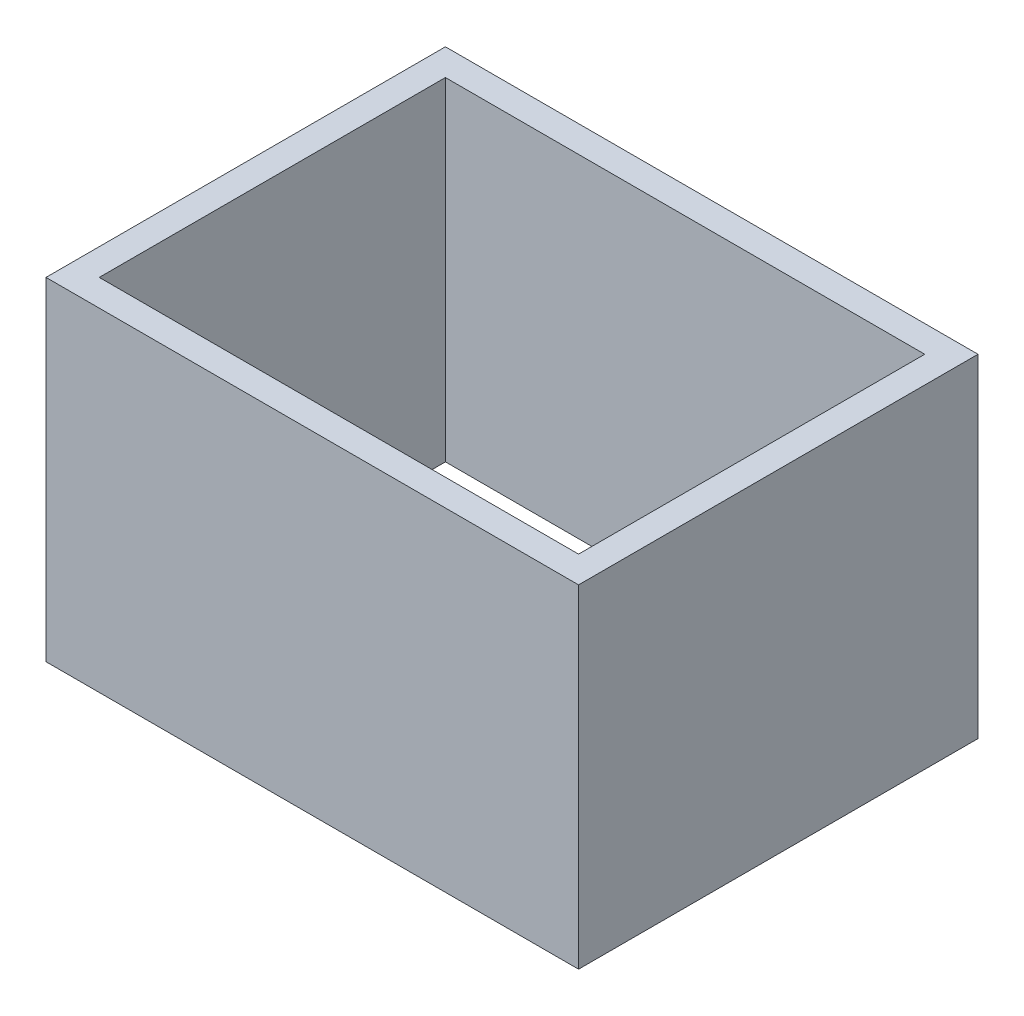
ISO-10303-21;
HEADER;
FILE_DESCRIPTION(('STEP AP214'),'2;1');
FILE_NAME('part.step','',(''),(''),'','','');
FILE_SCHEMA(('AUTOMOTIVE_DESIGN { 1 0 10303 214 1 1 1 1 }'));
ENDSEC;
DATA;
#1=APPLICATION_CONTEXT('core data for automotive mechanical design processes');
#2=APPLICATION_PROTOCOL_DEFINITION('international standard','automotive_design',2000,#1);
#3=PRODUCT_CONTEXT('',#1,'mechanical');
#4=PRODUCT('Part','Part','',(#3));
#5=PRODUCT_RELATED_PRODUCT_CATEGORY('part','',(#4));
#6=PRODUCT_DEFINITION_FORMATION('','',#4);
#7=PRODUCT_DEFINITION_CONTEXT('part definition',#1,'design');
#8=PRODUCT_DEFINITION('design','',#6,#7);
#9=PRODUCT_DEFINITION_SHAPE('','',#8);
#10=(LENGTH_UNIT() NAMED_UNIT(*) SI_UNIT(.MILLI.,.METRE.));
#11=(NAMED_UNIT(*) PLANE_ANGLE_UNIT() SI_UNIT($,.RADIAN.));
#12=(NAMED_UNIT(*) SI_UNIT($,.STERADIAN.) SOLID_ANGLE_UNIT());
#13=UNCERTAINTY_MEASURE_WITH_UNIT(LENGTH_MEASURE(1.E-05),#10,'distance_accuracy_value','');
#14=(GEOMETRIC_REPRESENTATION_CONTEXT(3) GLOBAL_UNCERTAINTY_ASSIGNED_CONTEXT((#13)) GLOBAL_UNIT_ASSIGNED_CONTEXT((#10,
#11,#12)) REPRESENTATION_CONTEXT('',''));
#15=CARTESIAN_POINT('',(0.,0.,0.));
#16=DIRECTION('',(0.,0.,1.));
#17=DIRECTION('',(1.,0.,0.));
#18=AXIS2_PLACEMENT_3D('',#15,#16,#17);
#19=CARTESIAN_POINT('',(0.,2500.,0.));
#20=DIRECTION('',(0.,-1.,0.));
#21=DIRECTION('',(0.,0.,-1.));
#22=AXIS2_PLACEMENT_3D('',#19,#20,#21);
#23=PLANE('',#22);
#24=DIRECTION('',(0.,0.,1.));
#25=VECTOR('',#24,1.);
#26=CARTESIAN_POINT('',(0.,2500.,0.));
#27=LINE('',#26,#25);
#28=CARTESIAN_POINT('',(0.,2500.,-3000.));
#29=VERTEX_POINT('',#28);
#30=CARTESIAN_POINT('',(0.,2500.,0.));
#31=VERTEX_POINT('',#30);
#32=EDGE_CURVE('E153',#29,#31,#27,.T.);
#33=ORIENTED_EDGE('',*,*,#32,.T.);
#34=DIRECTION('',(1.,0.,0.));
#35=VECTOR('',#34,1.);
#36=CARTESIAN_POINT('',(0.,2500.,0.));
#37=LINE('',#36,#35);
#38=CARTESIAN_POINT('',(4000.,2500.,0.));
#39=VERTEX_POINT('',#38);
#40=EDGE_CURVE('E157',#31,#39,#37,.T.);
#41=ORIENTED_EDGE('',*,*,#40,.T.);
#42=DIRECTION('',(0.,0.,-1.));
#43=VECTOR('',#42,1.);
#44=CARTESIAN_POINT('',(4000.,2500.,0.));
#45=LINE('',#44,#43);
#46=CARTESIAN_POINT('',(4000.,2500.,-3000.));
#47=VERTEX_POINT('',#46);
#48=EDGE_CURVE('E161',#39,#47,#45,.T.);
#49=ORIENTED_EDGE('',*,*,#48,.T.);
#50=DIRECTION('',(-1.,0.,0.));
#51=VECTOR('',#50,1.);
#52=CARTESIAN_POINT('',(0.,2500.,-3000.));
#53=LINE('',#52,#51);
#54=EDGE_CURVE('E164',#47,#29,#53,.T.);
#55=ORIENTED_EDGE('',*,*,#54,.T.);
#56=EDGE_LOOP('',(#33,#41,#49,#55));
#57=FACE_BOUND('',#56,.T.);
#58=DIRECTION('',(1.,0.,0.));
#59=VECTOR('',#58,1.);
#60=CARTESIAN_POINT('',(200.,2500.,-200.));
#61=LINE('',#60,#59);
#62=CARTESIAN_POINT('',(200.,2500.,-200.));
#63=VERTEX_POINT('',#62);
#64=CARTESIAN_POINT('',(3800.,2500.,-200.));
#65=VERTEX_POINT('',#64);
#66=EDGE_CURVE('E105',#63,#65,#61,.T.);
#67=ORIENTED_EDGE('',*,*,#66,.F.);
#68=DIRECTION('',(0.,0.,1.));
#69=VECTOR('',#68,1.);
#70=CARTESIAN_POINT('',(200.,2500.,-200.));
#71=LINE('',#70,#69);
#72=CARTESIAN_POINT('',(200.,2500.,-2800.));
#73=VERTEX_POINT('',#72);
#74=EDGE_CURVE('E131',#73,#63,#71,.T.);
#75=ORIENTED_EDGE('',*,*,#74,.F.);
#76=DIRECTION('',(-1.,0.,0.));
#77=VECTOR('',#76,1.);
#78=CARTESIAN_POINT('',(200.,2500.,-2800.));
#79=LINE('',#78,#77);
#80=CARTESIAN_POINT('',(3800.,2500.,-2800.));
#81=VERTEX_POINT('',#80);
#82=EDGE_CURVE('E127',#81,#73,#79,.T.);
#83=ORIENTED_EDGE('',*,*,#82,.F.);
#84=DIRECTION('',(0.,0.,-1.));
#85=VECTOR('',#84,1.);
#86=CARTESIAN_POINT('',(3800.,2500.,-200.));
#87=LINE('',#86,#85);
#88=EDGE_CURVE('E114',#65,#81,#87,.T.);
#89=ORIENTED_EDGE('',*,*,#88,.F.);
#90=EDGE_LOOP('',(#67,#75,#83,#89));
#91=FACE_BOUND('',#90,.T.);
#92=ADVANCED_FACE('F39',(#57,#91),#23,.F.);
#93=CARTESIAN_POINT('',(0.,0.,0.));
#94=DIRECTION('',(0.,-1.,0.));
#95=DIRECTION('',(0.,0.,-1.));
#96=AXIS2_PLACEMENT_3D('',#93,#94,#95);
#97=PLANE('',#96);
#98=DIRECTION('',(0.,0.,1.));
#99=VECTOR('',#98,1.);
#100=CARTESIAN_POINT('',(0.,0.,0.));
#101=LINE('',#100,#99);
#102=CARTESIAN_POINT('',(0.,0.,-3000.));
#103=VERTEX_POINT('',#102);
#104=CARTESIAN_POINT('',(0.,0.,0.));
#105=VERTEX_POINT('',#104);
#106=EDGE_CURVE('E123',#103,#105,#101,.T.);
#107=ORIENTED_EDGE('',*,*,#106,.F.);
#108=DIRECTION('',(-1.,0.,0.));
#109=VECTOR('',#108,1.);
#110=CARTESIAN_POINT('',(0.,0.,-3000.));
#111=LINE('',#110,#109);
#112=CARTESIAN_POINT('',(4000.,0.,-3000.));
#113=VERTEX_POINT('',#112);
#114=EDGE_CURVE('E158',#113,#103,#111,.T.);
#115=ORIENTED_EDGE('',*,*,#114,.F.);
#116=DIRECTION('',(0.,0.,-1.));
#117=VECTOR('',#116,1.);
#118=CARTESIAN_POINT('',(4000.,0.,0.));
#119=LINE('',#118,#117);
#120=CARTESIAN_POINT('',(4000.,0.,0.));
#121=VERTEX_POINT('',#120);
#122=EDGE_CURVE('E174',#121,#113,#119,.T.);
#123=ORIENTED_EDGE('',*,*,#122,.F.);
#124=DIRECTION('',(1.,0.,0.));
#125=VECTOR('',#124,1.);
#126=CARTESIAN_POINT('',(0.,0.,0.));
#127=LINE('',#126,#125);
#128=EDGE_CURVE('E171',#105,#121,#127,.T.);
#129=ORIENTED_EDGE('',*,*,#128,.F.);
#130=EDGE_LOOP('',(#107,#115,#123,#129));
#131=FACE_BOUND('',#130,.T.);
#132=DIRECTION('',(0.,0.,1.));
#133=VECTOR('',#132,1.);
#134=CARTESIAN_POINT('',(200.,0.,-200.));
#135=LINE('',#134,#133);
#136=CARTESIAN_POINT('',(200.,0.,-2800.));
#137=VERTEX_POINT('',#136);
#138=CARTESIAN_POINT('',(200.,0.,-200.));
#139=VERTEX_POINT('',#138);
#140=EDGE_CURVE('E115',#137,#139,#135,.T.);
#141=ORIENTED_EDGE('',*,*,#140,.T.);
#142=DIRECTION('',(1.,0.,0.));
#143=VECTOR('',#142,1.);
#144=CARTESIAN_POINT('',(200.,0.,-200.));
#145=LINE('',#144,#143);
#146=CARTESIAN_POINT('',(3800.,0.,-200.));
#147=VERTEX_POINT('',#146);
#148=EDGE_CURVE('E63',#139,#147,#145,.T.);
#149=ORIENTED_EDGE('',*,*,#148,.T.);
#150=DIRECTION('',(0.,0.,-1.));
#151=VECTOR('',#150,1.);
#152=CARTESIAN_POINT('',(3800.,0.,-200.));
#153=LINE('',#152,#151);
#154=CARTESIAN_POINT('',(3800.,0.,-2800.));
#155=VERTEX_POINT('',#154);
#156=EDGE_CURVE('E121',#147,#155,#153,.T.);
#157=ORIENTED_EDGE('',*,*,#156,.T.);
#158=DIRECTION('',(-1.,0.,0.));
#159=VECTOR('',#158,1.);
#160=CARTESIAN_POINT('',(200.,0.,-2800.));
#161=LINE('',#160,#159);
#162=EDGE_CURVE('E140',#155,#137,#161,.T.);
#163=ORIENTED_EDGE('',*,*,#162,.T.);
#164=EDGE_LOOP('',(#141,#149,#157,#163));
#165=FACE_BOUND('',#164,.T.);
#166=ADVANCED_FACE('F197',(#131,#165),#97,.T.);
#167=CARTESIAN_POINT('',(0.,2500.,0.));
#168=DIRECTION('',(1.,0.,0.));
#169=DIRECTION('',(0.,0.,-1.));
#170=AXIS2_PLACEMENT_3D('',#167,#168,#169);
#171=PLANE('',#170);
#172=ORIENTED_EDGE('',*,*,#106,.T.);
#173=DIRECTION('',(0.,-1.,0.));
#174=VECTOR('',#173,1.);
#175=CARTESIAN_POINT('',(0.,2500.,0.));
#176=LINE('',#175,#174);
#177=EDGE_CURVE('E11',#31,#105,#176,.T.);
#178=ORIENTED_EDGE('',*,*,#177,.F.);
#179=ORIENTED_EDGE('',*,*,#32,.F.);
#180=DIRECTION('',(0.,-1.,0.));
#181=VECTOR('',#180,1.);
#182=CARTESIAN_POINT('',(0.,2500.,-3000.));
#183=LINE('',#182,#181);
#184=EDGE_CURVE('E167',#29,#103,#183,.T.);
#185=ORIENTED_EDGE('',*,*,#184,.T.);
#186=EDGE_LOOP('',(#172,#178,#179,#185));
#187=FACE_BOUND('',#186,.T.);
#188=ADVANCED_FACE('F41',(#187),#171,.F.);
#189=CARTESIAN_POINT('',(0.,2500.,0.));
#190=DIRECTION('',(0.,0.,-1.));
#191=DIRECTION('',(-1.,0.,0.));
#192=AXIS2_PLACEMENT_3D('',#189,#190,#191);
#193=PLANE('',#192);
#194=ORIENTED_EDGE('',*,*,#128,.T.);
#195=DIRECTION('',(0.,-1.,0.));
#196=VECTOR('',#195,1.);
#197=CARTESIAN_POINT('',(4000.,2500.,0.));
#198=LINE('',#197,#196);
#199=EDGE_CURVE('E48',#39,#121,#198,.T.);
#200=ORIENTED_EDGE('',*,*,#199,.F.);
#201=ORIENTED_EDGE('',*,*,#40,.F.);
#202=ORIENTED_EDGE('',*,*,#177,.T.);
#203=EDGE_LOOP('',(#194,#200,#201,#202));
#204=FACE_BOUND('',#203,.T.);
#205=ADVANCED_FACE('F207',(#204),#193,.F.);
#206=CARTESIAN_POINT('',(4000.,2500.,0.));
#207=DIRECTION('',(-1.,0.,0.));
#208=DIRECTION('',(0.,0.,1.));
#209=AXIS2_PLACEMENT_3D('',#206,#207,#208);
#210=PLANE('',#209);
#211=ORIENTED_EDGE('',*,*,#122,.T.);
#212=DIRECTION('',(0.,-1.,0.));
#213=VECTOR('',#212,1.);
#214=CARTESIAN_POINT('',(4000.,2500.,-3000.));
#215=LINE('',#214,#213);
#216=EDGE_CURVE('E182',#47,#113,#215,.T.);
#217=ORIENTED_EDGE('',*,*,#216,.F.);
#218=ORIENTED_EDGE('',*,*,#48,.F.);
#219=ORIENTED_EDGE('',*,*,#199,.T.);
#220=EDGE_LOOP('',(#211,#217,#218,#219));
#221=FACE_BOUND('',#220,.T.);
#222=ADVANCED_FACE('F191',(#221),#210,.F.);
#223=CARTESIAN_POINT('',(0.,2500.,-3000.));
#224=DIRECTION('',(0.,0.,1.));
#225=DIRECTION('',(1.,0.,0.));
#226=AXIS2_PLACEMENT_3D('',#223,#224,#225);
#227=PLANE('',#226);
#228=ORIENTED_EDGE('',*,*,#114,.T.);
#229=ORIENTED_EDGE('',*,*,#184,.F.);
#230=ORIENTED_EDGE('',*,*,#54,.F.);
#231=ORIENTED_EDGE('',*,*,#216,.T.);
#232=EDGE_LOOP('',(#228,#229,#230,#231));
#233=FACE_BOUND('',#232,.T.);
#234=ADVANCED_FACE('F201',(#233),#227,.F.);
#235=CARTESIAN_POINT('',(200.,2500.,-200.));
#236=DIRECTION('',(0.,0.,-1.));
#237=DIRECTION('',(-1.,0.,0.));
#238=AXIS2_PLACEMENT_3D('',#235,#236,#237);
#239=PLANE('',#238);
#240=ORIENTED_EDGE('',*,*,#148,.F.);
#241=DIRECTION('',(0.,-1.,0.));
#242=VECTOR('',#241,1.);
#243=CARTESIAN_POINT('',(200.,2500.,-200.));
#244=LINE('',#243,#242);
#245=EDGE_CURVE('E109',#63,#139,#244,.T.);
#246=ORIENTED_EDGE('',*,*,#245,.F.);
#247=ORIENTED_EDGE('',*,*,#66,.T.);
#248=DIRECTION('',(0.,-1.,0.));
#249=VECTOR('',#248,1.);
#250=CARTESIAN_POINT('',(3800.,2500.,-200.));
#251=LINE('',#250,#249);
#252=EDGE_CURVE('E108',#65,#147,#251,.T.);
#253=ORIENTED_EDGE('',*,*,#252,.T.);
#254=EDGE_LOOP('',(#240,#246,#247,#253));
#255=FACE_BOUND('',#254,.T.);
#256=ADVANCED_FACE('F107',(#255),#239,.T.);
#257=CARTESIAN_POINT('',(3800.,2500.,-200.));
#258=DIRECTION('',(-1.,0.,0.));
#259=DIRECTION('',(0.,0.,1.));
#260=AXIS2_PLACEMENT_3D('',#257,#258,#259);
#261=PLANE('',#260);
#262=ORIENTED_EDGE('',*,*,#156,.F.);
#263=ORIENTED_EDGE('',*,*,#252,.F.);
#264=ORIENTED_EDGE('',*,*,#88,.T.);
#265=DIRECTION('',(0.,-1.,0.));
#266=VECTOR('',#265,1.);
#267=CARTESIAN_POINT('',(3800.,2500.,-2800.));
#268=LINE('',#267,#266);
#269=EDGE_CURVE('E124',#81,#155,#268,.T.);
#270=ORIENTED_EDGE('',*,*,#269,.T.);
#271=EDGE_LOOP('',(#262,#263,#264,#270));
#272=FACE_BOUND('',#271,.T.);
#273=ADVANCED_FACE('F118',(#272),#261,.T.);
#274=CARTESIAN_POINT('',(200.,2500.,-2800.));
#275=DIRECTION('',(0.,0.,1.));
#276=DIRECTION('',(1.,0.,0.));
#277=AXIS2_PLACEMENT_3D('',#274,#275,#276);
#278=PLANE('',#277);
#279=ORIENTED_EDGE('',*,*,#162,.F.);
#280=ORIENTED_EDGE('',*,*,#269,.F.);
#281=ORIENTED_EDGE('',*,*,#82,.T.);
#282=DIRECTION('',(0.,-1.,0.));
#283=VECTOR('',#282,1.);
#284=CARTESIAN_POINT('',(200.,2500.,-2800.));
#285=LINE('',#284,#283);
#286=EDGE_CURVE('E55',#73,#137,#285,.T.);
#287=ORIENTED_EDGE('',*,*,#286,.T.);
#288=EDGE_LOOP('',(#279,#280,#281,#287));
#289=FACE_BOUND('',#288,.T.);
#290=ADVANCED_FACE('F230',(#289),#278,.T.);
#291=CARTESIAN_POINT('',(200.,2500.,-200.));
#292=DIRECTION('',(1.,0.,0.));
#293=DIRECTION('',(0.,0.,-1.));
#294=AXIS2_PLACEMENT_3D('',#291,#292,#293);
#295=PLANE('',#294);
#296=ORIENTED_EDGE('',*,*,#140,.F.);
#297=ORIENTED_EDGE('',*,*,#286,.F.);
#298=ORIENTED_EDGE('',*,*,#74,.T.);
#299=ORIENTED_EDGE('',*,*,#245,.T.);
#300=EDGE_LOOP('',(#296,#297,#298,#299));
#301=FACE_BOUND('',#300,.T.);
#302=ADVANCED_FACE('F234',(#301),#295,.T.);
#303=CLOSED_SHELL('',(#92,#166,#188,#205,#222,#234,#256,#273,#290,#302));
#304=MANIFOLD_SOLID_BREP('B2',#303);
#305=ADVANCED_BREP_SHAPE_REPRESENTATION('',(#18,#304),#14);
#306=SHAPE_DEFINITION_REPRESENTATION(#9,#305);
ENDSEC;
END-ISO-10303-21;
